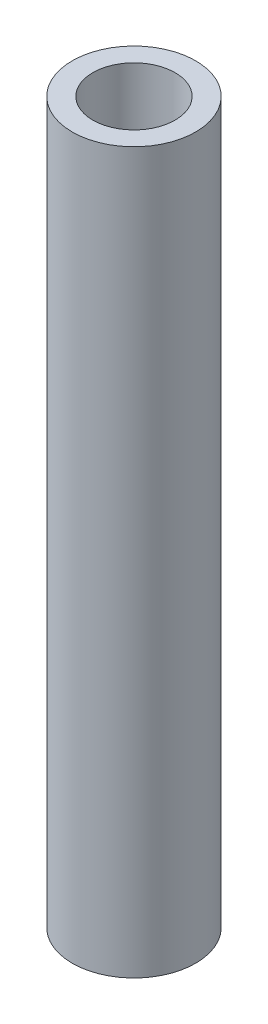
ISO-10303-21;
HEADER;
FILE_DESCRIPTION(('STEP AP214'),'2;1');
FILE_NAME('part.step','',(''),(''),'','','');
FILE_SCHEMA(('AUTOMOTIVE_DESIGN { 1 0 10303 214 1 1 1 1 }'));
ENDSEC;
DATA;
#1=APPLICATION_CONTEXT('core data for automotive mechanical design processes');
#2=APPLICATION_PROTOCOL_DEFINITION('international standard','automotive_design',2000,#1);
#3=PRODUCT_CONTEXT('',#1,'mechanical');
#4=PRODUCT('Part','Part','',(#3));
#5=PRODUCT_RELATED_PRODUCT_CATEGORY('part','',(#4));
#6=PRODUCT_DEFINITION_FORMATION('','',#4);
#7=PRODUCT_DEFINITION_CONTEXT('part definition',#1,'design');
#8=PRODUCT_DEFINITION('design','',#6,#7);
#9=PRODUCT_DEFINITION_SHAPE('','',#8);
#10=(LENGTH_UNIT() NAMED_UNIT(*) SI_UNIT(.MILLI.,.METRE.));
#11=(NAMED_UNIT(*) PLANE_ANGLE_UNIT() SI_UNIT($,.RADIAN.));
#12=(NAMED_UNIT(*) SI_UNIT($,.STERADIAN.) SOLID_ANGLE_UNIT());
#13=UNCERTAINTY_MEASURE_WITH_UNIT(LENGTH_MEASURE(1.E-05),#10,'distance_accuracy_value','');
#14=(GEOMETRIC_REPRESENTATION_CONTEXT(3) GLOBAL_UNCERTAINTY_ASSIGNED_CONTEXT((#13)) GLOBAL_UNIT_ASSIGNED_CONTEXT((#10,
#11,#12)) REPRESENTATION_CONTEXT('',''));
#15=CARTESIAN_POINT('',(0.,0.,0.));
#16=DIRECTION('',(0.,0.,1.));
#17=DIRECTION('',(1.,0.,0.));
#18=AXIS2_PLACEMENT_3D('',#15,#16,#17);
#19=CARTESIAN_POINT('',(0.,35.,0.));
#20=DIRECTION('',(0.,1.,0.));
#21=DIRECTION('',(0.,0.,1.));
#22=AXIS2_PLACEMENT_3D('',#19,#20,#21);
#23=PLANE('',#22);
#24=CARTESIAN_POINT('',(0.,35.,0.));
#25=DIRECTION('',(0.,1.,0.));
#26=DIRECTION('',(0.,0.,1.));
#27=AXIS2_PLACEMENT_3D('',#24,#25,#26);
#28=CIRCLE('',#27,3.);
#29=CARTESIAN_POINT('',(0.,35.,3.));
#30=VERTEX_POINT('',#29);
#31=EDGE_CURVE('E10',#30,#30,#28,.T.);
#32=ORIENTED_EDGE('',*,*,#31,.T.);
#33=EDGE_LOOP('',(#32));
#34=FACE_BOUND('',#33,.T.);
#35=CARTESIAN_POINT('',(0.,35.,0.));
#36=DIRECTION('',(0.,1.,0.));
#37=DIRECTION('',(0.,0.,1.));
#38=AXIS2_PLACEMENT_3D('',#35,#36,#37);
#39=CIRCLE('',#38,2.);
#40=CARTESIAN_POINT('',(0.,35.,2.));
#41=VERTEX_POINT('',#40);
#42=EDGE_CURVE('E42',#41,#41,#39,.T.);
#43=ORIENTED_EDGE('',*,*,#42,.F.);
#44=EDGE_LOOP('',(#43));
#45=FACE_BOUND('',#44,.T.);
#46=ADVANCED_FACE('F31',(#34,#45),#23,.T.);
#47=CARTESIAN_POINT('',(0.,0.,0.));
#48=DIRECTION('',(0.,1.,0.));
#49=DIRECTION('',(0.,0.,1.));
#50=AXIS2_PLACEMENT_3D('',#47,#48,#49);
#51=PLANE('',#50);
#52=CARTESIAN_POINT('',(0.,0.,0.));
#53=DIRECTION('',(0.,1.,0.));
#54=DIRECTION('',(0.,0.,1.));
#55=AXIS2_PLACEMENT_3D('',#52,#53,#54);
#56=CIRCLE('',#55,3.);
#57=CARTESIAN_POINT('',(0.,0.,3.));
#58=VERTEX_POINT('',#57);
#59=EDGE_CURVE('E35',#58,#58,#56,.T.);
#60=ORIENTED_EDGE('',*,*,#59,.F.);
#61=EDGE_LOOP('',(#60));
#62=FACE_BOUND('',#61,.T.);
#63=CARTESIAN_POINT('',(0.,0.,0.));
#64=DIRECTION('',(0.,1.,0.));
#65=DIRECTION('',(0.,0.,1.));
#66=AXIS2_PLACEMENT_3D('',#63,#64,#65);
#67=CIRCLE('',#66,2.);
#68=CARTESIAN_POINT('',(0.,0.,2.));
#69=VERTEX_POINT('',#68);
#70=EDGE_CURVE('E44',#69,#69,#67,.T.);
#71=ORIENTED_EDGE('',*,*,#70,.T.);
#72=EDGE_LOOP('',(#71));
#73=FACE_BOUND('',#72,.T.);
#74=ADVANCED_FACE('F54',(#62,#73),#51,.F.);
#75=CARTESIAN_POINT('',(0.,35.,0.));
#76=DIRECTION('',(0.,-1.,0.));
#77=DIRECTION('',(0.,0.,-1.));
#78=AXIS2_PLACEMENT_3D('',#75,#76,#77);
#79=CYLINDRICAL_SURFACE('',#78,3.);
#80=ORIENTED_EDGE('',*,*,#31,.F.);
#81=EDGE_LOOP('',(#80));
#82=FACE_BOUND('',#81,.T.);
#83=ORIENTED_EDGE('',*,*,#59,.T.);
#84=EDGE_LOOP('',(#83));
#85=FACE_BOUND('',#84,.T.);
#86=ADVANCED_FACE('F33',(#82,#85),#79,.T.);
#87=CARTESIAN_POINT('',(0.,35.,0.));
#88=DIRECTION('',(0.,-1.,0.));
#89=DIRECTION('',(0.,0.,-1.));
#90=AXIS2_PLACEMENT_3D('',#87,#88,#89);
#91=CYLINDRICAL_SURFACE('',#90,2.);
#92=ORIENTED_EDGE('',*,*,#42,.T.);
#93=EDGE_LOOP('',(#92));
#94=FACE_BOUND('',#93,.T.);
#95=ORIENTED_EDGE('',*,*,#70,.F.);
#96=EDGE_LOOP('',(#95));
#97=FACE_BOUND('',#96,.T.);
#98=ADVANCED_FACE('F50',(#94,#97),#91,.F.);
#99=CLOSED_SHELL('',(#46,#74,#86,#98));
#100=MANIFOLD_SOLID_BREP('B2',#99);
#101=ADVANCED_BREP_SHAPE_REPRESENTATION('',(#18,#100),#14);
#102=SHAPE_DEFINITION_REPRESENTATION(#9,#101);
ENDSEC;
END-ISO-10303-21;
